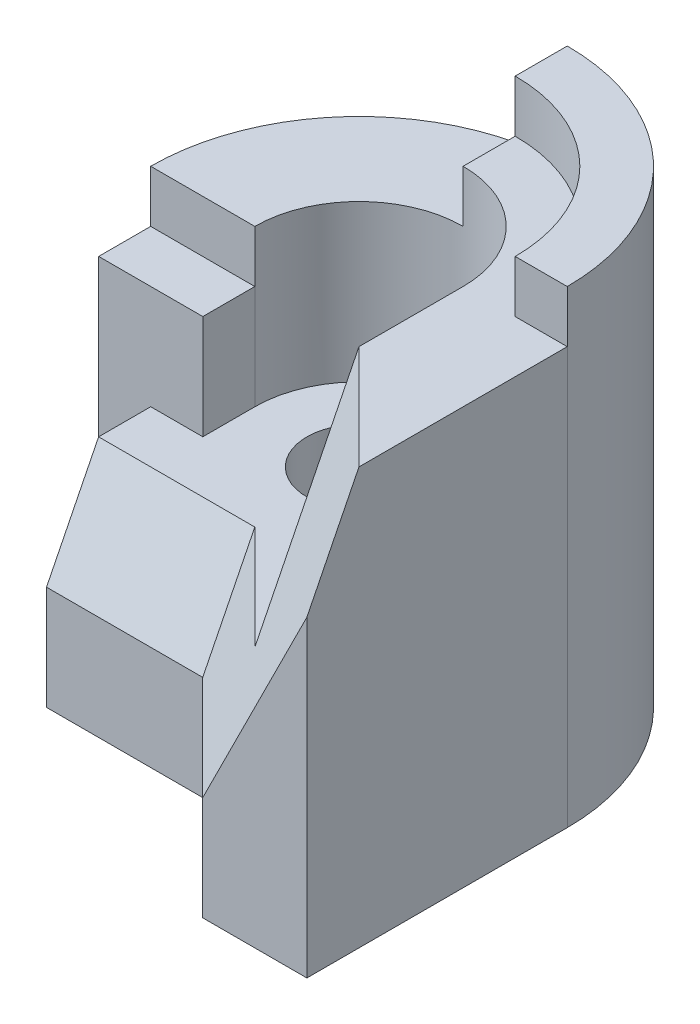
ISO-10303-21;
HEADER;
FILE_DESCRIPTION(('STEP AP214'),'2;1');
FILE_NAME('part.step','',(''),(''),'','','');
FILE_SCHEMA(('AUTOMOTIVE_DESIGN { 1 0 10303 214 1 1 1 1 }'));
ENDSEC;
DATA;
#1=APPLICATION_CONTEXT('core data for automotive mechanical design processes');
#2=APPLICATION_PROTOCOL_DEFINITION('international standard','automotive_design',2000,#1);
#3=PRODUCT_CONTEXT('',#1,'mechanical');
#4=PRODUCT('Part','Part','',(#3));
#5=PRODUCT_RELATED_PRODUCT_CATEGORY('part','',(#4));
#6=PRODUCT_DEFINITION_FORMATION('','',#4);
#7=PRODUCT_DEFINITION_CONTEXT('part definition',#1,'design');
#8=PRODUCT_DEFINITION('design','',#6,#7);
#9=PRODUCT_DEFINITION_SHAPE('','',#8);
#10=(LENGTH_UNIT() NAMED_UNIT(*) SI_UNIT(.MILLI.,.METRE.));
#11=(NAMED_UNIT(*) PLANE_ANGLE_UNIT() SI_UNIT($,.RADIAN.));
#12=(NAMED_UNIT(*) SI_UNIT($,.STERADIAN.) SOLID_ANGLE_UNIT());
#13=UNCERTAINTY_MEASURE_WITH_UNIT(LENGTH_MEASURE(1.E-05),#10,'distance_accuracy_value','');
#14=(GEOMETRIC_REPRESENTATION_CONTEXT(3) GLOBAL_UNCERTAINTY_ASSIGNED_CONTEXT((#13)) GLOBAL_UNIT_ASSIGNED_CONTEXT((#10,
#11,#12)) REPRESENTATION_CONTEXT('',''));
#15=CARTESIAN_POINT('',(0.,0.,0.));
#16=DIRECTION('',(0.,0.,1.));
#17=DIRECTION('',(1.,0.,0.));
#18=AXIS2_PLACEMENT_3D('',#15,#16,#17);
#19=CARTESIAN_POINT('',(0.,90.,30.));
#20=DIRECTION('',(0.707106781186547,0.,-0.707106781186547));
#21=DIRECTION('',(-0.707106781186548,0.,-0.707106781186548));
#22=AXIS2_PLACEMENT_3D('',#19,#20,#21);
#23=PLANE('',#22);
#24=DIRECTION('',(-0.707106781186548,0.,-0.707106781186548));
#25=VECTOR('',#24,1.);
#26=CARTESIAN_POINT('',(20.,20.,50.));
#27=LINE('',#26,#25);
#28=CARTESIAN_POINT('',(20.,20.,50.));
#29=VERTEX_POINT('',#28);
#30=CARTESIAN_POINT('',(0.,20.,30.));
#31=VERTEX_POINT('',#30);
#32=EDGE_CURVE('E333',#29,#31,#27,.T.);
#33=ORIENTED_EDGE('',*,*,#32,.T.);
#34=DIRECTION('',(0.,-1.,0.));
#35=VECTOR('',#34,1.);
#36=CARTESIAN_POINT('',(0.,90.,30.));
#37=LINE('',#36,#35);
#38=CARTESIAN_POINT('',(0.,0.,30.));
#39=VERTEX_POINT('',#38);
#40=EDGE_CURVE('E132',#31,#39,#37,.T.);
#41=ORIENTED_EDGE('',*,*,#40,.T.);
#42=DIRECTION('',(0.707106781186548,0.,0.707106781186548));
#43=VECTOR('',#42,1.);
#44=CARTESIAN_POINT('',(0.,0.,30.));
#45=LINE('',#44,#43);
#46=CARTESIAN_POINT('',(20.,0.,50.));
#47=VERTEX_POINT('',#46);
#48=EDGE_CURVE('E106',#39,#47,#45,.T.);
#49=ORIENTED_EDGE('',*,*,#48,.T.);
#50=DIRECTION('',(0.,-1.,0.));
#51=VECTOR('',#50,1.);
#52=CARTESIAN_POINT('',(20.,90.,50.));
#53=LINE('',#52,#51);
#54=EDGE_CURVE('E97',#29,#47,#53,.T.);
#55=ORIENTED_EDGE('',*,*,#54,.F.);
#56=EDGE_LOOP('',(#33,#41,#49,#55));
#57=FACE_BOUND('',#56,.T.);
#58=ADVANCED_FACE('F36',(#57),#23,.F.);
#59=CARTESIAN_POINT('',(20.,90.,50.));
#60=DIRECTION('',(0.,0.,-1.));
#61=DIRECTION('',(-1.,0.,0.));
#62=AXIS2_PLACEMENT_3D('',#59,#60,#61);
#63=PLANE('',#62);
#64=DIRECTION('',(-0.447213595499958,-0.894427190999916,0.));
#65=VECTOR('',#64,1.);
#66=CARTESIAN_POINT('',(40.,60.,50.));
#67=LINE('',#66,#65);
#68=CARTESIAN_POINT('',(40.,60.,50.));
#69=VERTEX_POINT('',#68);
#70=EDGE_CURVE('E391',#69,#29,#67,.T.);
#71=ORIENTED_EDGE('',*,*,#70,.T.);
#72=ORIENTED_EDGE('',*,*,#54,.T.);
#73=DIRECTION('',(1.,0.,0.));
#74=VECTOR('',#73,1.);
#75=CARTESIAN_POINT('',(20.,0.,50.));
#76=LINE('',#75,#74);
#77=CARTESIAN_POINT('',(40.,0.,50.));
#78=VERTEX_POINT('',#77);
#79=EDGE_CURVE('E100',#47,#78,#76,.T.);
#80=ORIENTED_EDGE('',*,*,#79,.T.);
#81=DIRECTION('',(0.,-1.,0.));
#82=VECTOR('',#81,1.);
#83=CARTESIAN_POINT('',(40.,90.,50.));
#84=LINE('',#83,#82);
#85=EDGE_CURVE('E84',#69,#78,#84,.T.);
#86=ORIENTED_EDGE('',*,*,#85,.F.);
#87=EDGE_LOOP('',(#71,#72,#80,#86));
#88=FACE_BOUND('',#87,.T.);
#89=ADVANCED_FACE('F101',(#88),#63,.F.);
#90=CARTESIAN_POINT('',(40.,90.,50.));
#91=DIRECTION('',(-1.,0.,0.));
#92=DIRECTION('',(0.,0.,1.));
#93=AXIS2_PLACEMENT_3D('',#90,#91,#92);
#94=PLANE('',#93);
#95=DIRECTION('',(0.,-0.894427190999916,0.447213595499958));
#96=VECTOR('',#95,1.);
#97=CARTESIAN_POINT('',(40.,80.,40.));
#98=LINE('',#97,#96);
#99=CARTESIAN_POINT('',(40.,80.,40.));
#100=VERTEX_POINT('',#99);
#101=EDGE_CURVE('E94',#100,#69,#98,.T.);
#102=ORIENTED_EDGE('',*,*,#101,.T.);
#103=ORIENTED_EDGE('',*,*,#85,.T.);
#104=DIRECTION('',(0.,0.,-1.));
#105=VECTOR('',#104,1.);
#106=CARTESIAN_POINT('',(40.,0.,50.));
#107=LINE('',#106,#105);
#108=CARTESIAN_POINT('',(40.,0.,0.));
#109=VERTEX_POINT('',#108);
#110=EDGE_CURVE('E89',#78,#109,#107,.T.);
#111=ORIENTED_EDGE('',*,*,#110,.T.);
#112=DIRECTION('',(0.,-1.,0.));
#113=VECTOR('',#112,1.);
#114=CARTESIAN_POINT('',(40.,90.,0.));
#115=LINE('',#114,#113);
#116=CARTESIAN_POINT('',(40.,80.,0.));
#117=VERTEX_POINT('',#116);
#118=EDGE_CURVE('E117',#117,#109,#115,.T.);
#119=ORIENTED_EDGE('',*,*,#118,.F.);
#120=DIRECTION('',(0.,0.,-1.));
#121=VECTOR('',#120,1.);
#122=CARTESIAN_POINT('',(40.,80.,0.));
#123=LINE('',#122,#121);
#124=EDGE_CURVE('E157',#100,#117,#123,.T.);
#125=ORIENTED_EDGE('',*,*,#124,.F.);
#126=EDGE_LOOP('',(#102,#103,#111,#119,#125));
#127=FACE_BOUND('',#126,.T.);
#128=ADVANCED_FACE('F86',(#127),#94,.F.);
#129=CARTESIAN_POINT('',(20.,70.,0.));
#130=DIRECTION('',(-1.,0.,0.));
#131=DIRECTION('',(0.,0.,1.));
#132=AXIS2_PLACEMENT_3D('',#129,#130,#131);
#133=PLANE('',#132);
#134=DIRECTION('',(0.,0.,-1.));
#135=VECTOR('',#134,1.);
#136=CARTESIAN_POINT('',(20.,40.,44.96504658729));
#137=LINE('',#136,#135);
#138=CARTESIAN_POINT('',(20.,40.,40.));
#139=VERTEX_POINT('',#138);
#140=CARTESIAN_POINT('',(20.,40.,0.));
#141=VERTEX_POINT('',#140);
#142=EDGE_CURVE('E128',#139,#141,#137,.T.);
#143=ORIENTED_EDGE('',*,*,#142,.F.);
#144=DIRECTION('',(0.,0.894427190999916,-0.447213595499958));
#145=VECTOR('',#144,1.);
#146=CARTESIAN_POINT('',(20.,40.,40.));
#147=LINE('',#146,#145);
#148=CARTESIAN_POINT('',(20.,80.,20.));
#149=VERTEX_POINT('',#148);
#150=EDGE_CURVE('E384',#139,#149,#147,.T.);
#151=ORIENTED_EDGE('',*,*,#150,.T.);
#152=DIRECTION('',(0.,0.,1.));
#153=VECTOR('',#152,1.);
#154=CARTESIAN_POINT('',(20.,80.,20.));
#155=LINE('',#154,#153);
#156=CARTESIAN_POINT('',(20.,80.,0.));
#157=VERTEX_POINT('',#156);
#158=EDGE_CURVE('E165',#157,#149,#155,.T.);
#159=ORIENTED_EDGE('',*,*,#158,.F.);
#160=DIRECTION('',(0.,1.,0.));
#161=VECTOR('',#160,1.);
#162=CARTESIAN_POINT('',(20.,70.,0.));
#163=LINE('',#162,#161);
#164=EDGE_CURVE('E245',#141,#157,#163,.T.);
#165=ORIENTED_EDGE('',*,*,#164,.F.);
#166=EDGE_LOOP('',(#143,#151,#159,#165));
#167=FACE_BOUND('',#166,.T.);
#168=ADVANCED_FACE('F387',(#167),#133,.T.);
#169=CARTESIAN_POINT('',(0.,40.,0.));
#170=DIRECTION('',(0.,-1.,0.));
#171=DIRECTION('',(0.,0.,-1.));
#172=AXIS2_PLACEMENT_3D('',#169,#170,#171);
#173=PLANE('',#172);
#174=CARTESIAN_POINT('',(0.,40.,0.));
#175=DIRECTION('',(0.,-1.,0.));
#176=DIRECTION('',(0.,0.,-1.));
#177=AXIS2_PLACEMENT_3D('',#174,#175,#176);
#178=CIRCLE('',#177,10.);
#179=CARTESIAN_POINT('',(0.,40.,10.));
#180=VERTEX_POINT('',#179);
#181=EDGE_CURVE('E359',#180,#180,#178,.F.);
#182=ORIENTED_EDGE('',*,*,#181,.F.);
#183=EDGE_LOOP('',(#182));
#184=FACE_BOUND('',#183,.T.);
#185=DIRECTION('',(0.707106781186547,0.,0.707106781186548));
#186=VECTOR('',#185,1.);
#187=CARTESIAN_POINT('',(0.,40.,20.));
#188=LINE('',#187,#186);
#189=CARTESIAN_POINT('',(0.,40.,20.));
#190=VERTEX_POINT('',#189);
#191=EDGE_CURVE('E335',#190,#139,#188,.T.);
#192=ORIENTED_EDGE('',*,*,#191,.T.);
#193=ORIENTED_EDGE('',*,*,#142,.T.);
#194=CARTESIAN_POINT('',(0.,40.,0.));
#195=DIRECTION('',(0.,1.,0.));
#196=DIRECTION('',(0.,0.,-1.));
#197=AXIS2_PLACEMENT_3D('',#194,#195,#196);
#198=CIRCLE('',#197,20.);
#199=CARTESIAN_POINT('',(-20.,40.,0.));
#200=VERTEX_POINT('',#199);
#201=EDGE_CURVE('E345',#141,#200,#198,.T.);
#202=ORIENTED_EDGE('',*,*,#201,.T.);
#203=DIRECTION('',(0.,0.,1.));
#204=VECTOR('',#203,1.);
#205=CARTESIAN_POINT('',(-20.,40.,0.));
#206=LINE('',#205,#204);
#207=CARTESIAN_POINT('',(-20.,40.,9.98607228845579));
#208=VERTEX_POINT('',#207);
#209=EDGE_CURVE('E348',#200,#208,#206,.T.);
#210=ORIENTED_EDGE('',*,*,#209,.T.);
#211=DIRECTION('',(-1.,0.,0.));
#212=VECTOR('',#211,1.);
#213=CARTESIAN_POINT('',(-20.,40.,9.98607228845579));
#214=LINE('',#213,#212);
#215=CARTESIAN_POINT('',(-30.,40.,9.98607228845579));
#216=VERTEX_POINT('',#215);
#217=EDGE_CURVE('E351',#208,#216,#214,.T.);
#218=ORIENTED_EDGE('',*,*,#217,.T.);
#219=DIRECTION('',(0.,0.,1.));
#220=VECTOR('',#219,1.);
#221=CARTESIAN_POINT('',(-30.,40.,9.98607228845579));
#222=LINE('',#221,#220);
#223=CARTESIAN_POINT('',(-30.,40.,20.));
#224=VERTEX_POINT('',#223);
#225=EDGE_CURVE('E222',#216,#224,#222,.T.);
#226=ORIENTED_EDGE('',*,*,#225,.T.);
#227=DIRECTION('',(-1.,0.,0.));
#228=VECTOR('',#227,1.);
#229=CARTESIAN_POINT('',(0.,40.,20.));
#230=LINE('',#229,#228);
#231=EDGE_CURVE('E136',#190,#224,#230,.T.);
#232=ORIENTED_EDGE('',*,*,#231,.F.);
#233=EDGE_LOOP('',(#192,#193,#202,#210,#218,#226,#232));
#234=FACE_BOUND('',#233,.T.);
#235=ADVANCED_FACE('F402',(#184,#234),#173,.F.);
#236=CARTESIAN_POINT('',(0.,70.,0.));
#237=DIRECTION('',(0.,1.,0.));
#238=DIRECTION('',(0.,0.,1.));
#239=AXIS2_PLACEMENT_3D('',#236,#237,#238);
#240=PLANE('',#239);
#241=CARTESIAN_POINT('',(0.,70.,0.));
#242=DIRECTION('',(0.,1.,0.));
#243=DIRECTION('',(0.,0.,-1.));
#244=AXIS2_PLACEMENT_3D('',#241,#242,#243);
#245=CIRCLE('',#244,20.);
#246=CARTESIAN_POINT('',(0.,70.,-20.));
#247=VERTEX_POINT('',#246);
#248=CARTESIAN_POINT('',(-20.,70.,0.));
#249=VERTEX_POINT('',#248);
#250=EDGE_CURVE('E147',#247,#249,#245,.T.);
#251=ORIENTED_EDGE('',*,*,#250,.F.);
#252=DIRECTION('',(0.,0.,-1.));
#253=VECTOR('',#252,1.);
#254=CARTESIAN_POINT('',(0.,70.,0.));
#255=LINE('',#254,#253);
#256=CARTESIAN_POINT('',(0.,70.,-40.));
#257=VERTEX_POINT('',#256);
#258=EDGE_CURVE('E233',#247,#257,#255,.T.);
#259=ORIENTED_EDGE('',*,*,#258,.T.);
#260=CARTESIAN_POINT('',(0.,70.,0.));
#261=DIRECTION('',(0.,1.,0.));
#262=DIRECTION('',(0.,0.,1.));
#263=AXIS2_PLACEMENT_3D('',#260,#261,#262);
#264=CIRCLE('',#263,40.);
#265=CARTESIAN_POINT('',(-40.,70.,0.));
#266=VERTEX_POINT('',#265);
#267=EDGE_CURVE('E243',#257,#266,#264,.T.);
#268=ORIENTED_EDGE('',*,*,#267,.T.);
#269=DIRECTION('',(-1.,0.,0.));
#270=VECTOR('',#269,1.);
#271=CARTESIAN_POINT('',(-40.,70.,0.));
#272=LINE('',#271,#270);
#273=EDGE_CURVE('E365',#249,#266,#272,.T.);
#274=ORIENTED_EDGE('',*,*,#273,.F.);
#275=EDGE_LOOP('',(#251,#259,#268,#274));
#276=FACE_BOUND('',#275,.T.);
#277=ADVANCED_FACE('F431',(#276),#240,.T.);
#278=CARTESIAN_POINT('',(-30.,90.,0.));
#279=DIRECTION('',(1.,0.,0.));
#280=DIRECTION('',(0.,0.,-1.));
#281=AXIS2_PLACEMENT_3D('',#278,#279,#280);
#282=PLANE('',#281);
#283=DIRECTION('',(0.,-1.,0.));
#284=VECTOR('',#283,1.);
#285=CARTESIAN_POINT('',(-30.,90.,30.));
#286=LINE('',#285,#284);
#287=CARTESIAN_POINT('',(-30.,20.,30.));
#288=VERTEX_POINT('',#287);
#289=CARTESIAN_POINT('',(-30.,0.,30.));
#290=VERTEX_POINT('',#289);
#291=EDGE_CURVE('E151',#288,#290,#286,.T.);
#292=ORIENTED_EDGE('',*,*,#291,.F.);
#293=DIRECTION('',(0.,-0.894427190999916,0.447213595499958));
#294=VECTOR('',#293,1.);
#295=CARTESIAN_POINT('',(-30.,40.,20.));
#296=LINE('',#295,#294);
#297=EDGE_CURVE('E137',#224,#288,#296,.T.);
#298=ORIENTED_EDGE('',*,*,#297,.F.);
#299=ORIENTED_EDGE('',*,*,#225,.F.);
#300=DIRECTION('',(0.,1.,0.));
#301=VECTOR('',#300,1.);
#302=CARTESIAN_POINT('',(-30.,0.,9.98607228845579));
#303=LINE('',#302,#301);
#304=CARTESIAN_POINT('',(-30.,0.,9.98607228845579));
#305=VERTEX_POINT('',#304);
#306=EDGE_CURVE('E219',#305,#216,#303,.T.);
#307=ORIENTED_EDGE('',*,*,#306,.F.);
#308=DIRECTION('',(0.,0.,1.));
#309=VECTOR('',#308,1.);
#310=CARTESIAN_POINT('',(-30.,0.,0.));
#311=LINE('',#310,#309);
#312=EDGE_CURVE('E195',#305,#290,#311,.T.);
#313=ORIENTED_EDGE('',*,*,#312,.T.);
#314=EDGE_LOOP('',(#292,#298,#299,#307,#313));
#315=FACE_BOUND('',#314,.T.);
#316=ADVANCED_FACE('F216',(#315),#282,.F.);
#317=CARTESIAN_POINT('',(-30.,90.,30.));
#318=DIRECTION('',(0.,0.,-1.));
#319=DIRECTION('',(-1.,0.,0.));
#320=AXIS2_PLACEMENT_3D('',#317,#318,#319);
#321=PLANE('',#320);
#322=ORIENTED_EDGE('',*,*,#40,.F.);
#323=DIRECTION('',(-1.,0.,0.));
#324=VECTOR('',#323,1.);
#325=CARTESIAN_POINT('',(0.,20.,30.));
#326=LINE('',#325,#324);
#327=EDGE_CURVE('E142',#31,#288,#326,.T.);
#328=ORIENTED_EDGE('',*,*,#327,.T.);
#329=ORIENTED_EDGE('',*,*,#291,.T.);
#330=DIRECTION('',(1.,0.,0.));
#331=VECTOR('',#330,1.);
#332=CARTESIAN_POINT('',(-30.,0.,30.));
#333=LINE('',#332,#331);
#334=EDGE_CURVE('E198',#290,#39,#333,.T.);
#335=ORIENTED_EDGE('',*,*,#334,.T.);
#336=EDGE_LOOP('',(#322,#328,#329,#335));
#337=FACE_BOUND('',#336,.T.);
#338=ADVANCED_FACE('F208',(#337),#321,.F.);
#339=CARTESIAN_POINT('',(0.,0.,0.));
#340=DIRECTION('',(0.,1.,0.));
#341=DIRECTION('',(0.,0.,1.));
#342=AXIS2_PLACEMENT_3D('',#339,#340,#341);
#343=CYLINDRICAL_SURFACE('',#342,10.);
#344=CARTESIAN_POINT('',(0.,0.,0.));
#345=DIRECTION('',(0.,1.,0.));
#346=DIRECTION('',(0.,0.,1.));
#347=AXIS2_PLACEMENT_3D('',#344,#345,#346);
#348=CIRCLE('',#347,10.);
#349=CARTESIAN_POINT('',(0.,0.,10.));
#350=VERTEX_POINT('',#349);
#351=EDGE_CURVE('E190',#350,#350,#348,.T.);
#352=CARTESIAN_POINT('',(0.,40.,10.));
#353=CARTESIAN_POINT('',(0.,39.5833333333333,10.));
#354=CARTESIAN_POINT('',(0.,39.1666666666667,10.));
#355=CARTESIAN_POINT('',(0.,38.3333333333333,10.));
#356=CARTESIAN_POINT('',(0.,37.9166666666667,10.));
#357=CARTESIAN_POINT('',(0.,37.0833333333333,10.));
#358=CARTESIAN_POINT('',(0.,36.6666666666667,10.));
#359=CARTESIAN_POINT('',(0.,35.8333333333333,10.));
#360=CARTESIAN_POINT('',(0.,35.4166666666667,10.));
#361=CARTESIAN_POINT('',(0.,34.5833333333333,10.));
#362=CARTESIAN_POINT('',(0.,34.1666666666667,10.));
#363=CARTESIAN_POINT('',(0.,33.3333333333333,10.));
#364=CARTESIAN_POINT('',(0.,32.9166666666667,10.));
#365=CARTESIAN_POINT('',(0.,32.0833333333333,10.));
#366=CARTESIAN_POINT('',(0.,31.6666666666667,10.));
#367=CARTESIAN_POINT('',(0.,30.8333333333333,10.));
#368=CARTESIAN_POINT('',(0.,30.4166666666667,10.));
#369=CARTESIAN_POINT('',(0.,29.5833333333333,10.));
#370=CARTESIAN_POINT('',(0.,29.1666666666667,10.));
#371=CARTESIAN_POINT('',(0.,28.3333333333333,10.));
#372=CARTESIAN_POINT('',(0.,27.9166666666667,10.));
#373=CARTESIAN_POINT('',(0.,27.0833333333333,10.));
#374=CARTESIAN_POINT('',(0.,26.6666666666667,10.));
#375=CARTESIAN_POINT('',(0.,25.8333333333333,10.));
#376=CARTESIAN_POINT('',(0.,25.4166666666667,10.));
#377=CARTESIAN_POINT('',(0.,24.5833333333333,10.));
#378=CARTESIAN_POINT('',(0.,24.1666666666667,10.));
#379=CARTESIAN_POINT('',(0.,23.3333333333333,10.));
#380=CARTESIAN_POINT('',(0.,22.9166666666667,10.));
#381=CARTESIAN_POINT('',(0.,22.0833333333333,10.));
#382=CARTESIAN_POINT('',(0.,21.6666666666667,10.));
#383=CARTESIAN_POINT('',(0.,20.8333333333333,10.));
#384=CARTESIAN_POINT('',(0.,20.4166666666667,10.));
#385=CARTESIAN_POINT('',(0.,19.5833333333333,10.));
#386=CARTESIAN_POINT('',(0.,19.1666666666667,10.));
#387=CARTESIAN_POINT('',(0.,18.3333333333333,10.));
#388=CARTESIAN_POINT('',(0.,17.9166666666667,10.));
#389=CARTESIAN_POINT('',(0.,17.0833333333333,10.));
#390=CARTESIAN_POINT('',(0.,16.6666666666667,10.));
#391=CARTESIAN_POINT('',(0.,15.8333333333333,10.));
#392=CARTESIAN_POINT('',(0.,15.4166666666667,10.));
#393=CARTESIAN_POINT('',(0.,14.5833333333333,10.));
#394=CARTESIAN_POINT('',(0.,14.1666666666667,10.));
#395=CARTESIAN_POINT('',(0.,13.3333333333333,10.));
#396=CARTESIAN_POINT('',(0.,12.9166666666667,10.));
#397=CARTESIAN_POINT('',(0.,12.0833333333333,10.));
#398=CARTESIAN_POINT('',(0.,11.6666666666667,10.));
#399=CARTESIAN_POINT('',(0.,10.8333333333333,10.));
#400=CARTESIAN_POINT('',(0.,10.4166666666667,10.));
#401=CARTESIAN_POINT('',(0.,9.58333333333333,10.));
#402=CARTESIAN_POINT('',(0.,9.16666666666667,10.));
#403=CARTESIAN_POINT('',(0.,8.33333333333333,10.));
#404=CARTESIAN_POINT('',(0.,7.91666666666667,10.));
#405=CARTESIAN_POINT('',(0.,7.08333333333333,10.));
#406=CARTESIAN_POINT('',(0.,6.66666666666666,10.));
#407=CARTESIAN_POINT('',(0.,5.83333333333333,10.));
#408=CARTESIAN_POINT('',(0.,5.41666666666667,10.));
#409=CARTESIAN_POINT('',(0.,4.58333333333334,10.));
#410=CARTESIAN_POINT('',(0.,4.16666666666667,10.));
#411=CARTESIAN_POINT('',(0.,3.33333333333334,10.));
#412=CARTESIAN_POINT('',(0.,2.91666666666667,10.));
#413=CARTESIAN_POINT('',(0.,2.08333333333333,10.));
#414=CARTESIAN_POINT('',(0.,1.66666666666667,10.));
#415=CARTESIAN_POINT('',(0.,0.833333333333334,10.));
#416=CARTESIAN_POINT('',(0.,0.416666666666667,10.));
#417=CARTESIAN_POINT('',(0.,0.,10.));
#418=B_SPLINE_CURVE_WITH_KNOTS('',3,(#352,#353,#354,#355,#356,#357,#358,#359,#360,#361,#362,
#363,#364,#365,#366,#367,#368,#369,#370,#371,#372,#373,#374,#375,#376,#377,#378,#379,#380,#381,
#382,#383,#384,#385,#386,#387,#388,#389,#390,#391,#392,#393,#394,#395,#396,#397,#398,#399,#400,
#401,#402,#403,#404,#405,#406,#407,#408,#409,#410,#411,#412,#413,#414,#415,#416,#417),
.UNSPECIFIED.,.F.,.F.,(4,2,2,2,2,2,2,2,2,2,2,2,2,2,2,2,2,2,2,2,2,2,2,2,2,2,2,2,2,2,2,2,4),(0.,
1.25,2.5,3.75,5.,6.25,7.5,8.75,10.,11.25,12.5,13.75,15.,16.25,17.5,18.75,20.,21.25,22.5,23.75,
25.,26.25,27.5,28.75,30.,31.25,32.5,33.75,35.,36.25,37.5,38.75,40.),.UNSPECIFIED.);
#419=EDGE_CURVE('BSEAM429',#180,#350,#418,.T.);
#420=ORIENTED_EDGE('',*,*,#181,.T.);
#421=ORIENTED_EDGE('',*,*,#351,.F.);
#422=ORIENTED_EDGE('',*,*,#419,.T.);
#423=ORIENTED_EDGE('',*,*,#419,.F.);
#424=EDGE_LOOP('',(#420,#422,#421,#423));
#425=FACE_BOUND('',#424,.T.);
#426=ADVANCED_FACE('F429',(#425),#343,.F.);
#427=CARTESIAN_POINT('',(0.,90.,0.));
#428=DIRECTION('',(0.,-1.,0.));
#429=DIRECTION('',(0.,0.,-1.));
#430=AXIS2_PLACEMENT_3D('',#427,#428,#429);
#431=CYLINDRICAL_SURFACE('',#430,40.);
#432=ORIENTED_EDGE('',*,*,#267,.F.);
#433=DIRECTION('',(0.,1.,0.));
#434=VECTOR('',#433,1.);
#435=CARTESIAN_POINT('',(0.,70.,-40.));
#436=LINE('',#435,#434);
#437=CARTESIAN_POINT('',(0.,90.,-40.));
#438=VERTEX_POINT('',#437);
#439=EDGE_CURVE('E186',#257,#438,#436,.T.);
#440=ORIENTED_EDGE('',*,*,#439,.T.);
#441=CARTESIAN_POINT('',(0.,90.,0.));
#442=DIRECTION('',(0.,1.,0.));
#443=DIRECTION('',(0.,0.,-1.));
#444=AXIS2_PLACEMENT_3D('',#441,#442,#443);
#445=CIRCLE('',#444,40.);
#446=CARTESIAN_POINT('',(40.,90.,0.));
#447=VERTEX_POINT('',#446);
#448=EDGE_CURVE('E114',#447,#438,#445,.T.);
#449=ORIENTED_EDGE('',*,*,#448,.F.);
#450=EDGE_CURVE('E61',#447,#117,#115,.T.);
#451=ORIENTED_EDGE('',*,*,#450,.T.);
#452=ORIENTED_EDGE('',*,*,#118,.T.);
#453=CARTESIAN_POINT('',(0.,0.,0.));
#454=DIRECTION('',(0.,1.,0.));
#455=DIRECTION('',(0.,0.,-1.));
#456=AXIS2_PLACEMENT_3D('',#453,#454,#455);
#457=CIRCLE('',#456,40.);
#458=CARTESIAN_POINT('',(-40.,0.,0.));
#459=VERTEX_POINT('',#458);
#460=EDGE_CURVE('E113',#109,#459,#457,.T.);
#461=ORIENTED_EDGE('',*,*,#460,.T.);
#462=DIRECTION('',(0.,-1.,0.));
#463=VECTOR('',#462,1.);
#464=CARTESIAN_POINT('',(-40.,90.,0.));
#465=LINE('',#464,#463);
#466=CARTESIAN_POINT('',(-40.,60.,0.));
#467=VERTEX_POINT('',#466);
#468=EDGE_CURVE('E45',#467,#459,#465,.T.);
#469=ORIENTED_EDGE('',*,*,#468,.F.);
#470=EDGE_CURVE('E12',#266,#467,#465,.T.);
#471=ORIENTED_EDGE('',*,*,#470,.F.);
#472=EDGE_LOOP('',(#432,#440,#449,#451,#452,#461,#469,#471));
#473=FACE_BOUND('',#472,.T.);
#474=ADVANCED_FACE('F38',(#473),#431,.T.);
#475=CARTESIAN_POINT('',(0.,90.,0.));
#476=DIRECTION('',(0.,-1.,0.));
#477=DIRECTION('',(0.,0.,-1.));
#478=AXIS2_PLACEMENT_3D('',#475,#476,#477);
#479=PLANE('',#478);
#480=ORIENTED_EDGE('',*,*,#448,.T.);
#481=DIRECTION('',(0.,0.,-1.));
#482=VECTOR('',#481,1.);
#483=CARTESIAN_POINT('',(0.,90.,0.));
#484=LINE('',#483,#482);
#485=CARTESIAN_POINT('',(0.,90.,-30.));
#486=VERTEX_POINT('',#485);
#487=EDGE_CURVE('E229',#486,#438,#484,.T.);
#488=ORIENTED_EDGE('',*,*,#487,.F.);
#489=CARTESIAN_POINT('',(0.,90.,0.));
#490=DIRECTION('',(0.,1.,0.));
#491=DIRECTION('',(0.,0.,-1.));
#492=AXIS2_PLACEMENT_3D('',#489,#490,#491);
#493=CIRCLE('',#492,30.);
#494=CARTESIAN_POINT('',(30.,90.,0.));
#495=VERTEX_POINT('',#494);
#496=EDGE_CURVE('E158',#495,#486,#493,.T.);
#497=ORIENTED_EDGE('',*,*,#496,.F.);
#498=DIRECTION('',(-1.,0.,0.));
#499=VECTOR('',#498,1.);
#500=CARTESIAN_POINT('',(30.,90.,0.));
#501=LINE('',#500,#499);
#502=EDGE_CURVE('E184',#447,#495,#501,.T.);
#503=ORIENTED_EDGE('',*,*,#502,.F.);
#504=EDGE_LOOP('',(#480,#488,#497,#503));
#505=FACE_BOUND('',#504,.T.);
#506=ADVANCED_FACE('F461',(#505),#479,.F.);
#507=CARTESIAN_POINT('',(0.,0.,0.));
#508=DIRECTION('',(0.,-1.,0.));
#509=DIRECTION('',(0.,0.,-1.));
#510=AXIS2_PLACEMENT_3D('',#507,#508,#509);
#511=PLANE('',#510);
#512=ORIENTED_EDGE('',*,*,#312,.F.);
#513=DIRECTION('',(1.,0.,0.));
#514=VECTOR('',#513,1.);
#515=CARTESIAN_POINT('',(-30.,0.,9.98607228845579));
#516=LINE('',#515,#514);
#517=CARTESIAN_POINT('',(-40.,0.,9.98607228845579));
#518=VERTEX_POINT('',#517);
#519=EDGE_CURVE('E236',#518,#305,#516,.T.);
#520=ORIENTED_EDGE('',*,*,#519,.F.);
#521=DIRECTION('',(0.,0.,1.));
#522=VECTOR('',#521,1.);
#523=CARTESIAN_POINT('',(-40.,0.,0.));
#524=LINE('',#523,#522);
#525=EDGE_CURVE('E374',#459,#518,#524,.T.);
#526=ORIENTED_EDGE('',*,*,#525,.F.);
#527=ORIENTED_EDGE('',*,*,#460,.F.);
#528=ORIENTED_EDGE('',*,*,#110,.F.);
#529=ORIENTED_EDGE('',*,*,#79,.F.);
#530=ORIENTED_EDGE('',*,*,#48,.F.);
#531=ORIENTED_EDGE('',*,*,#334,.F.);
#532=EDGE_LOOP('',(#512,#520,#526,#527,#528,#529,#530,#531));
#533=FACE_BOUND('',#532,.T.);
#534=ORIENTED_EDGE('',*,*,#351,.T.);
#535=EDGE_LOOP('',(#534));
#536=FACE_BOUND('',#535,.T.);
#537=ADVANCED_FACE('F109',(#533,#536),#511,.T.);
#538=CARTESIAN_POINT('',(0.,80.,0.));
#539=DIRECTION('',(0.,1.,0.));
#540=DIRECTION('',(0.,0.,1.));
#541=AXIS2_PLACEMENT_3D('',#538,#539,#540);
#542=CYLINDRICAL_SURFACE('',#541,30.);
#543=ORIENTED_EDGE('',*,*,#496,.T.);
#544=DIRECTION('',(0.,1.,0.));
#545=VECTOR('',#544,1.);
#546=CARTESIAN_POINT('',(0.,80.,-30.));
#547=LINE('',#546,#545);
#548=CARTESIAN_POINT('',(0.,80.,-30.));
#549=VERTEX_POINT('',#548);
#550=EDGE_CURVE('E174',#549,#486,#547,.T.);
#551=ORIENTED_EDGE('',*,*,#550,.F.);
#552=CARTESIAN_POINT('',(0.,80.,0.));
#553=DIRECTION('',(0.,1.,0.));
#554=DIRECTION('',(0.,0.,-1.));
#555=AXIS2_PLACEMENT_3D('',#552,#553,#554);
#556=CIRCLE('',#555,30.);
#557=CARTESIAN_POINT('',(30.,80.,0.));
#558=VERTEX_POINT('',#557);
#559=EDGE_CURVE('E180',#558,#549,#556,.T.);
#560=ORIENTED_EDGE('',*,*,#559,.F.);
#561=DIRECTION('',(0.,1.,0.));
#562=VECTOR('',#561,1.);
#563=CARTESIAN_POINT('',(30.,80.,0.));
#564=LINE('',#563,#562);
#565=EDGE_CURVE('E167',#558,#495,#564,.T.);
#566=ORIENTED_EDGE('',*,*,#565,.T.);
#567=EDGE_LOOP('',(#543,#551,#560,#566));
#568=FACE_BOUND('',#567,.T.);
#569=ADVANCED_FACE('F266',(#568),#542,.F.);
#570=CARTESIAN_POINT('',(30.,80.,0.));
#571=DIRECTION('',(0.,0.,-1.));
#572=DIRECTION('',(-1.,0.,0.));
#573=AXIS2_PLACEMENT_3D('',#570,#571,#572);
#574=PLANE('',#573);
#575=ORIENTED_EDGE('',*,*,#502,.T.);
#576=ORIENTED_EDGE('',*,*,#565,.F.);
#577=DIRECTION('',(-1.,0.,0.));
#578=VECTOR('',#577,1.);
#579=CARTESIAN_POINT('',(30.,80.,0.));
#580=LINE('',#579,#578);
#581=EDGE_CURVE('E163',#117,#558,#580,.T.);
#582=ORIENTED_EDGE('',*,*,#581,.F.);
#583=ORIENTED_EDGE('',*,*,#450,.F.);
#584=EDGE_LOOP('',(#575,#576,#582,#583));
#585=FACE_BOUND('',#584,.T.);
#586=ADVANCED_FACE('F453',(#585),#574,.F.);
#587=CARTESIAN_POINT('',(0.,80.,0.));
#588=DIRECTION('',(0.,1.,0.));
#589=DIRECTION('',(0.,0.,1.));
#590=AXIS2_PLACEMENT_3D('',#587,#588,#589);
#591=PLANE('',#590);
#592=DIRECTION('',(0.707106781186548,0.,0.707106781186547));
#593=VECTOR('',#592,1.);
#594=CARTESIAN_POINT('',(40.,80.,40.));
#595=LINE('',#594,#593);
#596=EDGE_CURVE('E154',#149,#100,#595,.T.);
#597=ORIENTED_EDGE('',*,*,#596,.T.);
#598=ORIENTED_EDGE('',*,*,#124,.T.);
#599=ORIENTED_EDGE('',*,*,#581,.T.);
#600=ORIENTED_EDGE('',*,*,#559,.T.);
#601=DIRECTION('',(0.,0.,1.));
#602=VECTOR('',#601,1.);
#603=CARTESIAN_POINT('',(0.,80.,-20.));
#604=LINE('',#603,#602);
#605=CARTESIAN_POINT('',(0.,80.,-20.));
#606=VERTEX_POINT('',#605);
#607=EDGE_CURVE('E176',#549,#606,#604,.T.);
#608=ORIENTED_EDGE('',*,*,#607,.T.);
#609=CARTESIAN_POINT('',(0.,80.,0.));
#610=DIRECTION('',(0.,-1.,0.));
#611=DIRECTION('',(0.,0.,1.));
#612=AXIS2_PLACEMENT_3D('',#609,#610,#611);
#613=CIRCLE('',#612,20.);
#614=EDGE_CURVE('E168',#606,#157,#613,.T.);
#615=ORIENTED_EDGE('',*,*,#614,.T.);
#616=ORIENTED_EDGE('',*,*,#158,.T.);
#617=EDGE_LOOP('',(#597,#598,#599,#600,#608,#615,#616));
#618=FACE_BOUND('',#617,.T.);
#619=ADVANCED_FACE('F258',(#618),#591,.T.);
#620=CARTESIAN_POINT('',(0.,70.,0.));
#621=DIRECTION('',(1.,0.,0.));
#622=DIRECTION('',(0.,0.,-1.));
#623=AXIS2_PLACEMENT_3D('',#620,#621,#622);
#624=PLANE('',#623);
#625=ORIENTED_EDGE('',*,*,#487,.T.);
#626=ORIENTED_EDGE('',*,*,#439,.F.);
#627=ORIENTED_EDGE('',*,*,#258,.F.);
#628=DIRECTION('',(0.,1.,0.));
#629=VECTOR('',#628,1.);
#630=CARTESIAN_POINT('',(0.,70.,-20.));
#631=LINE('',#630,#629);
#632=EDGE_CURVE('E249',#247,#606,#631,.T.);
#633=ORIENTED_EDGE('',*,*,#632,.T.);
#634=ORIENTED_EDGE('',*,*,#607,.F.);
#635=ORIENTED_EDGE('',*,*,#550,.T.);
#636=EDGE_LOOP('',(#625,#626,#627,#633,#634,#635));
#637=FACE_BOUND('',#636,.T.);
#638=ADVANCED_FACE('F442',(#637),#624,.F.);
#639=CARTESIAN_POINT('',(0.,70.,0.));
#640=DIRECTION('',(0.,1.,0.));
#641=DIRECTION('',(0.,0.,1.));
#642=AXIS2_PLACEMENT_3D('',#639,#640,#641);
#643=CYLINDRICAL_SURFACE('',#642,20.);
#644=ORIENTED_EDGE('',*,*,#614,.F.);
#645=ORIENTED_EDGE('',*,*,#632,.F.);
#646=ORIENTED_EDGE('',*,*,#250,.T.);
#647=DIRECTION('',(0.,1.,0.));
#648=VECTOR('',#647,1.);
#649=CARTESIAN_POINT('',(-20.,60.,0.));
#650=LINE('',#649,#648);
#651=CARTESIAN_POINT('',(-20.,60.,0.));
#652=VERTEX_POINT('',#651);
#653=EDGE_CURVE('E371',#652,#249,#650,.T.);
#654=ORIENTED_EDGE('',*,*,#653,.F.);
#655=DIRECTION('',(0.,1.,0.));
#656=VECTOR('',#655,1.);
#657=CARTESIAN_POINT('',(-20.,40.,0.));
#658=LINE('',#657,#656);
#659=EDGE_CURVE('E360',#200,#652,#658,.T.);
#660=ORIENTED_EDGE('',*,*,#659,.F.);
#661=ORIENTED_EDGE('',*,*,#201,.F.);
#662=ORIENTED_EDGE('',*,*,#164,.T.);
#663=EDGE_LOOP('',(#644,#645,#646,#654,#660,#661,#662));
#664=FACE_BOUND('',#663,.T.);
#665=ADVANCED_FACE('F417',(#664),#643,.F.);
#666=CARTESIAN_POINT('',(-30.,0.,9.98607228845579));
#667=DIRECTION('',(0.,0.,1.));
#668=DIRECTION('',(1.,0.,0.));
#669=AXIS2_PLACEMENT_3D('',#666,#667,#668);
#670=PLANE('',#669);
#671=DIRECTION('',(1.,0.,0.));
#672=VECTOR('',#671,1.);
#673=CARTESIAN_POINT('',(-40.,60.,9.98607228845579));
#674=LINE('',#673,#672);
#675=CARTESIAN_POINT('',(-40.,60.,9.98607228845579));
#676=VERTEX_POINT('',#675);
#677=CARTESIAN_POINT('',(-20.,60.,9.98607228845579));
#678=VERTEX_POINT('',#677);
#679=EDGE_CURVE('E364',#676,#678,#674,.T.);
#680=ORIENTED_EDGE('',*,*,#679,.F.);
#681=DIRECTION('',(0.,1.,0.));
#682=VECTOR('',#681,1.);
#683=CARTESIAN_POINT('',(-40.,0.,9.98607228845579));
#684=LINE('',#683,#682);
#685=EDGE_CURVE('E230',#518,#676,#684,.T.);
#686=ORIENTED_EDGE('',*,*,#685,.F.);
#687=ORIENTED_EDGE('',*,*,#519,.T.);
#688=ORIENTED_EDGE('',*,*,#306,.T.);
#689=ORIENTED_EDGE('',*,*,#217,.F.);
#690=DIRECTION('',(0.,1.,0.));
#691=VECTOR('',#690,1.);
#692=CARTESIAN_POINT('',(-20.,40.,9.98607228845579));
#693=LINE('',#692,#691);
#694=EDGE_CURVE('E356',#208,#678,#693,.T.);
#695=ORIENTED_EDGE('',*,*,#694,.T.);
#696=EDGE_LOOP('',(#680,#686,#687,#688,#689,#695));
#697=FACE_BOUND('',#696,.T.);
#698=ADVANCED_FACE('F377',(#697),#670,.T.);
#699=CARTESIAN_POINT('',(-40.,0.,0.));
#700=DIRECTION('',(-1.,0.,0.));
#701=DIRECTION('',(0.,0.,1.));
#702=AXIS2_PLACEMENT_3D('',#699,#700,#701);
#703=PLANE('',#702);
#704=DIRECTION('',(0.,0.,1.));
#705=VECTOR('',#704,1.);
#706=CARTESIAN_POINT('',(-40.,60.,9.98607228845579));
#707=LINE('',#706,#705);
#708=EDGE_CURVE('E362',#467,#676,#707,.T.);
#709=ORIENTED_EDGE('',*,*,#708,.F.);
#710=ORIENTED_EDGE('',*,*,#468,.T.);
#711=ORIENTED_EDGE('',*,*,#525,.T.);
#712=ORIENTED_EDGE('',*,*,#685,.T.);
#713=EDGE_LOOP('',(#709,#710,#711,#712));
#714=FACE_BOUND('',#713,.T.);
#715=ADVANCED_FACE('F407',(#714),#703,.T.);
#716=CARTESIAN_POINT('',(-40.,60.,0.));
#717=DIRECTION('',(0.,0.,-1.));
#718=DIRECTION('',(-1.,0.,0.));
#719=AXIS2_PLACEMENT_3D('',#716,#717,#718);
#720=PLANE('',#719);
#721=ORIENTED_EDGE('',*,*,#273,.T.);
#722=ORIENTED_EDGE('',*,*,#470,.T.);
#723=DIRECTION('',(-1.,0.,0.));
#724=VECTOR('',#723,1.);
#725=CARTESIAN_POINT('',(-40.,60.,0.));
#726=LINE('',#725,#724);
#727=EDGE_CURVE('E53',#652,#467,#726,.T.);
#728=ORIENTED_EDGE('',*,*,#727,.F.);
#729=ORIENTED_EDGE('',*,*,#653,.T.);
#730=EDGE_LOOP('',(#721,#722,#728,#729));
#731=FACE_BOUND('',#730,.T.);
#732=ADVANCED_FACE('F409',(#731),#720,.F.);
#733=CARTESIAN_POINT('',(0.,60.,0.));
#734=DIRECTION('',(0.,-1.,0.));
#735=DIRECTION('',(0.,0.,-1.));
#736=AXIS2_PLACEMENT_3D('',#733,#734,#735);
#737=PLANE('',#736);
#738=ORIENTED_EDGE('',*,*,#708,.T.);
#739=ORIENTED_EDGE('',*,*,#679,.T.);
#740=DIRECTION('',(0.,0.,-1.));
#741=VECTOR('',#740,1.);
#742=CARTESIAN_POINT('',(-20.,60.,9.98607228845579));
#743=LINE('',#742,#741);
#744=EDGE_CURVE('E368',#678,#652,#743,.T.);
#745=ORIENTED_EDGE('',*,*,#744,.T.);
#746=ORIENTED_EDGE('',*,*,#727,.T.);
#747=EDGE_LOOP('',(#738,#739,#745,#746));
#748=FACE_BOUND('',#747,.T.);
#749=ADVANCED_FACE('F405',(#748),#737,.F.);
#750=CARTESIAN_POINT('',(-20.,40.,0.));
#751=DIRECTION('',(-1.,0.,0.));
#752=DIRECTION('',(0.,0.,1.));
#753=AXIS2_PLACEMENT_3D('',#750,#751,#752);
#754=PLANE('',#753);
#755=ORIENTED_EDGE('',*,*,#694,.F.);
#756=ORIENTED_EDGE('',*,*,#209,.F.);
#757=ORIENTED_EDGE('',*,*,#659,.T.);
#758=ORIENTED_EDGE('',*,*,#744,.F.);
#759=EDGE_LOOP('',(#755,#756,#757,#758));
#760=FACE_BOUND('',#759,.T.);
#761=ADVANCED_FACE('F504',(#760),#754,.F.);
#762=CARTESIAN_POINT('',(0.,40.,20.));
#763=DIRECTION('',(0.,-0.447213595499958,-0.894427190999916));
#764=DIRECTION('',(0.,0.894427190999916,-0.447213595499958));
#765=AXIS2_PLACEMENT_3D('',#762,#763,#764);
#766=PLANE('',#765);
#767=ORIENTED_EDGE('',*,*,#297,.T.);
#768=ORIENTED_EDGE('',*,*,#327,.F.);
#769=DIRECTION('',(0.,-0.894427190999916,0.447213595499958));
#770=VECTOR('',#769,1.);
#771=CARTESIAN_POINT('',(0.,40.,20.));
#772=LINE('',#771,#770);
#773=EDGE_CURVE('E133',#190,#31,#772,.T.);
#774=ORIENTED_EDGE('',*,*,#773,.F.);
#775=ORIENTED_EDGE('',*,*,#231,.T.);
#776=EDGE_LOOP('',(#767,#768,#774,#775));
#777=FACE_BOUND('',#776,.T.);
#778=ADVANCED_FACE('F339',(#777),#766,.F.);
#779=CARTESIAN_POINT('',(-17.7777777777778,8.88888888888889,17.7777777777778));
#780=DIRECTION('',(-0.666666666666666,0.333333333333333,0.666666666666667));
#781=DIRECTION('',(0.707106781186548,0.,0.707106781186547));
#782=AXIS2_PLACEMENT_3D('',#779,#780,#781);
#783=PLANE('',#782);
#784=ORIENTED_EDGE('',*,*,#32,.F.);
#785=ORIENTED_EDGE('',*,*,#70,.F.);
#786=ORIENTED_EDGE('',*,*,#101,.F.);
#787=ORIENTED_EDGE('',*,*,#596,.F.);
#788=ORIENTED_EDGE('',*,*,#150,.F.);
#789=ORIENTED_EDGE('',*,*,#191,.F.);
#790=ORIENTED_EDGE('',*,*,#773,.T.);
#791=EDGE_LOOP('',(#784,#785,#786,#787,#788,#789,#790));
#792=FACE_BOUND('',#791,.T.);
#793=ADVANCED_FACE('F332',(#792),#783,.T.);
#794=CLOSED_SHELL('',(#58,#89,#128,#168,#235,#277,#316,#338,#426,#474,#506,#537,#569,#586,#619,
#638,#665,#698,#715,#732,#749,#761,#778,#793));
#795=MANIFOLD_SOLID_BREP('B2',#794);
#796=ADVANCED_BREP_SHAPE_REPRESENTATION('',(#18,#795),#14);
#797=SHAPE_DEFINITION_REPRESENTATION(#9,#796);
ENDSEC;
END-ISO-10303-21;
